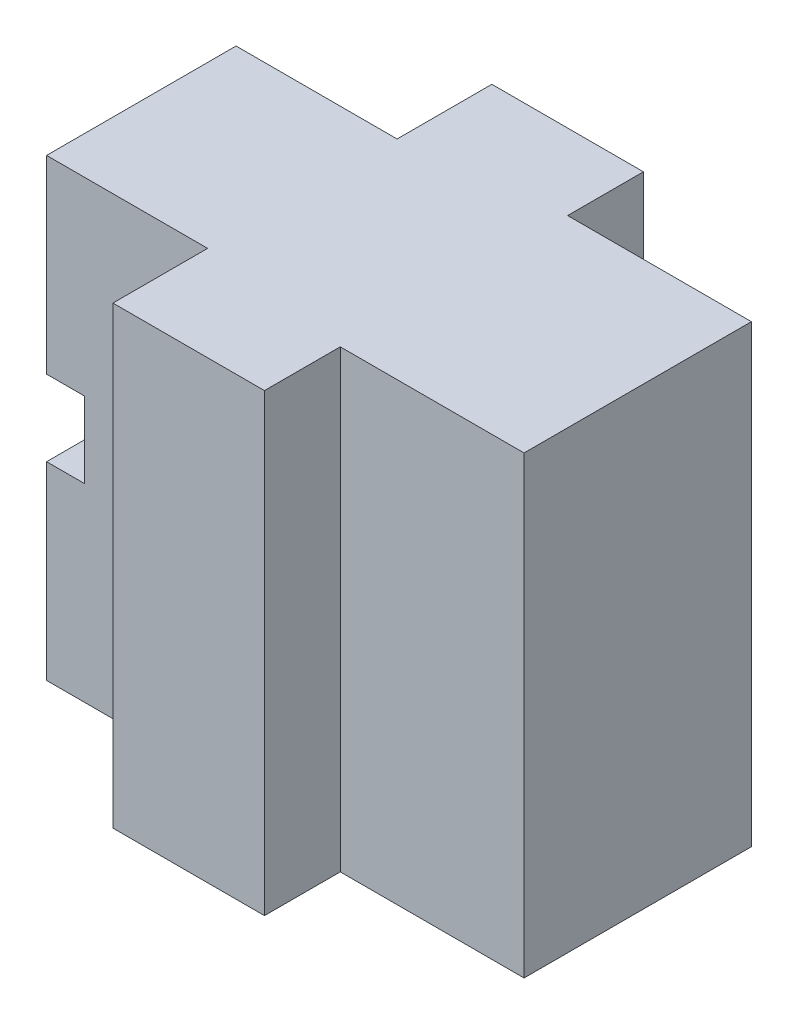
ISO-10303-21;
HEADER;
FILE_DESCRIPTION(('STEP AP214'),'2;1');
FILE_NAME('part.step','',(''),(''),'','','');
FILE_SCHEMA(('AUTOMOTIVE_DESIGN { 1 0 10303 214 1 1 1 1 }'));
ENDSEC;
DATA;
#1=APPLICATION_CONTEXT('core data for automotive mechanical design processes');
#2=APPLICATION_PROTOCOL_DEFINITION('international standard','automotive_design',2000,#1);
#3=PRODUCT_CONTEXT('',#1,'mechanical');
#4=PRODUCT('Part','Part','',(#3));
#5=PRODUCT_RELATED_PRODUCT_CATEGORY('part','',(#4));
#6=PRODUCT_DEFINITION_FORMATION('','',#4);
#7=PRODUCT_DEFINITION_CONTEXT('part definition',#1,'design');
#8=PRODUCT_DEFINITION('design','',#6,#7);
#9=PRODUCT_DEFINITION_SHAPE('','',#8);
#10=(LENGTH_UNIT() NAMED_UNIT(*) SI_UNIT(.MILLI.,.METRE.));
#11=(NAMED_UNIT(*) PLANE_ANGLE_UNIT() SI_UNIT($,.RADIAN.));
#12=(NAMED_UNIT(*) SI_UNIT($,.STERADIAN.) SOLID_ANGLE_UNIT());
#13=UNCERTAINTY_MEASURE_WITH_UNIT(LENGTH_MEASURE(1.E-05),#10,'distance_accuracy_value','');
#14=(GEOMETRIC_REPRESENTATION_CONTEXT(3) GLOBAL_UNCERTAINTY_ASSIGNED_CONTEXT((#13)) GLOBAL_UNIT_ASSIGNED_CONTEXT((#10,
#11,#12)) REPRESENTATION_CONTEXT('',''));
#15=CARTESIAN_POINT('',(0.,0.,0.));
#16=DIRECTION('',(0.,0.,1.));
#17=DIRECTION('',(1.,0.,0.));
#18=AXIS2_PLACEMENT_3D('',#15,#16,#17);
#19=CARTESIAN_POINT('',(0.,12.,5.));
#20=DIRECTION('',(-1.,0.,0.));
#21=DIRECTION('',(0.,-1.,0.));
#22=AXIS2_PLACEMENT_3D('',#19,#20,#21);
#23=PLANE('',#22);
#24=DIRECTION('',(0.,1.,0.));
#25=VECTOR('',#24,1.);
#26=CARTESIAN_POINT('',(0.,-27.4301652615907,-6.));
#27=LINE('',#26,#25);
#28=CARTESIAN_POINT('',(0.,-12.,-6.));
#29=VERTEX_POINT('',#28);
#30=CARTESIAN_POINT('',(0.,12.,-6.));
#31=VERTEX_POINT('',#30);
#32=EDGE_CURVE('E55',#29,#31,#27,.T.);
#33=ORIENTED_EDGE('',*,*,#32,.F.);
#34=DIRECTION('',(0.,0.,-1.));
#35=VECTOR('',#34,1.);
#36=CARTESIAN_POINT('',(0.,-12.,5.));
#37=LINE('',#36,#35);
#38=CARTESIAN_POINT('',(0.,-12.,-10.));
#39=VERTEX_POINT('',#38);
#40=EDGE_CURVE('E271',#29,#39,#37,.T.);
#41=ORIENTED_EDGE('',*,*,#40,.T.);
#42=DIRECTION('',(0.,1.,0.));
#43=VECTOR('',#42,1.);
#44=CARTESIAN_POINT('',(0.,-12.,-10.));
#45=LINE('',#44,#43);
#46=CARTESIAN_POINT('',(0.,12.,-10.));
#47=VERTEX_POINT('',#46);
#48=EDGE_CURVE('E211',#39,#47,#45,.T.);
#49=ORIENTED_EDGE('',*,*,#48,.T.);
#50=DIRECTION('',(0.,0.,-1.));
#51=VECTOR('',#50,1.);
#52=CARTESIAN_POINT('',(0.,12.,5.));
#53=LINE('',#52,#51);
#54=EDGE_CURVE('E269',#31,#47,#53,.T.);
#55=ORIENTED_EDGE('',*,*,#54,.F.);
#56=EDGE_LOOP('',(#33,#41,#49,#55));
#57=FACE_BOUND('',#56,.T.);
#58=ADVANCED_FACE('F32',(#57),#23,.F.);
#59=CARTESIAN_POINT('',(-14.5,-2.,5.));
#60=DIRECTION('',(0.,0.,1.));
#61=DIRECTION('',(1.,0.,0.));
#62=AXIS2_PLACEMENT_3D('',#59,#60,#61);
#63=PLANE('',#62);
#64=DIRECTION('',(1.,0.,0.));
#65=VECTOR('',#64,1.);
#66=CARTESIAN_POINT('',(0.,-12.,5.));
#67=LINE('',#66,#65);
#68=CARTESIAN_POINT('',(-16.5,-12.,5.));
#69=VERTEX_POINT('',#68);
#70=CARTESIAN_POINT('',(-8.,-12.,5.));
#71=VERTEX_POINT('',#70);
#72=EDGE_CURVE('E233',#69,#71,#67,.T.);
#73=ORIENTED_EDGE('',*,*,#72,.T.);
#74=DIRECTION('',(0.,1.,0.));
#75=VECTOR('',#74,1.);
#76=CARTESIAN_POINT('',(-8.,-2.,5.));
#77=LINE('',#76,#75);
#78=CARTESIAN_POINT('',(-8.,12.,5.));
#79=VERTEX_POINT('',#78);
#80=EDGE_CURVE('E223',#71,#79,#77,.T.);
#81=ORIENTED_EDGE('',*,*,#80,.T.);
#82=DIRECTION('',(-1.,0.,0.));
#83=VECTOR('',#82,1.);
#84=CARTESIAN_POINT('',(-16.5,12.,5.));
#85=LINE('',#84,#83);
#86=CARTESIAN_POINT('',(-16.5,12.,5.));
#87=VERTEX_POINT('',#86);
#88=EDGE_CURVE('E235',#79,#87,#85,.T.);
#89=ORIENTED_EDGE('',*,*,#88,.T.);
#90=DIRECTION('',(0.,-1.,0.));
#91=VECTOR('',#90,1.);
#92=CARTESIAN_POINT('',(-16.5,2.,5.));
#93=LINE('',#92,#91);
#94=CARTESIAN_POINT('',(-16.5,2.,5.));
#95=VERTEX_POINT('',#94);
#96=EDGE_CURVE('E237',#87,#95,#93,.T.);
#97=ORIENTED_EDGE('',*,*,#96,.T.);
#98=DIRECTION('',(1.,0.,0.));
#99=VECTOR('',#98,1.);
#100=CARTESIAN_POINT('',(-14.5,2.,5.));
#101=LINE('',#100,#99);
#102=CARTESIAN_POINT('',(-14.5,2.,5.));
#103=VERTEX_POINT('',#102);
#104=EDGE_CURVE('E239',#95,#103,#101,.T.);
#105=ORIENTED_EDGE('',*,*,#104,.T.);
#106=DIRECTION('',(0.,-1.,0.));
#107=VECTOR('',#106,1.);
#108=CARTESIAN_POINT('',(-14.5,-2.,5.));
#109=LINE('',#108,#107);
#110=CARTESIAN_POINT('',(-14.5,-2.,5.));
#111=VERTEX_POINT('',#110);
#112=EDGE_CURVE('E241',#103,#111,#109,.T.);
#113=ORIENTED_EDGE('',*,*,#112,.T.);
#114=DIRECTION('',(-1.,0.,0.));
#115=VECTOR('',#114,1.);
#116=CARTESIAN_POINT('',(-16.5,-2.,5.));
#117=LINE('',#116,#115);
#118=CARTESIAN_POINT('',(-16.5,-2.,5.));
#119=VERTEX_POINT('',#118);
#120=EDGE_CURVE('E227',#111,#119,#117,.T.);
#121=ORIENTED_EDGE('',*,*,#120,.T.);
#122=DIRECTION('',(0.,-1.,0.));
#123=VECTOR('',#122,1.);
#124=CARTESIAN_POINT('',(-16.5,-12.,5.));
#125=LINE('',#124,#123);
#126=EDGE_CURVE('E230',#119,#69,#125,.T.);
#127=ORIENTED_EDGE('',*,*,#126,.T.);
#128=EDGE_LOOP('',(#73,#81,#89,#97,#105,#113,#121,#127));
#129=FACE_BOUND('',#128,.T.);
#130=ADVANCED_FACE('F299',(#129),#63,.T.);
#131=CARTESIAN_POINT('',(-14.5,-2.,-5.));
#132=DIRECTION('',(0.,0.,1.));
#133=DIRECTION('',(1.,0.,0.));
#134=AXIS2_PLACEMENT_3D('',#131,#132,#133);
#135=PLANE('',#134);
#136=DIRECTION('',(0.,1.,0.));
#137=VECTOR('',#136,1.);
#138=CARTESIAN_POINT('',(-8.,-2.,-5.));
#139=LINE('',#138,#137);
#140=CARTESIAN_POINT('',(-8.,-12.,-5.));
#141=VERTEX_POINT('',#140);
#142=CARTESIAN_POINT('',(-8.,12.,-5.));
#143=VERTEX_POINT('',#142);
#144=EDGE_CURVE('E11',#141,#143,#139,.T.);
#145=ORIENTED_EDGE('',*,*,#144,.F.);
#146=DIRECTION('',(1.,0.,0.));
#147=VECTOR('',#146,1.);
#148=CARTESIAN_POINT('',(0.,-12.,-5.));
#149=LINE('',#148,#147);
#150=CARTESIAN_POINT('',(-16.5,-12.,-5.));
#151=VERTEX_POINT('',#150);
#152=EDGE_CURVE('E248',#151,#141,#149,.T.);
#153=ORIENTED_EDGE('',*,*,#152,.F.);
#154=DIRECTION('',(0.,-1.,0.));
#155=VECTOR('',#154,1.);
#156=CARTESIAN_POINT('',(-16.5,-12.,-5.));
#157=LINE('',#156,#155);
#158=CARTESIAN_POINT('',(-16.5,-2.,-5.));
#159=VERTEX_POINT('',#158);
#160=EDGE_CURVE('E246',#159,#151,#157,.T.);
#161=ORIENTED_EDGE('',*,*,#160,.F.);
#162=DIRECTION('',(-1.,0.,0.));
#163=VECTOR('',#162,1.);
#164=CARTESIAN_POINT('',(-16.5,-2.,-5.));
#165=LINE('',#164,#163);
#166=CARTESIAN_POINT('',(-14.5,-2.,-5.));
#167=VERTEX_POINT('',#166);
#168=EDGE_CURVE('E226',#167,#159,#165,.T.);
#169=ORIENTED_EDGE('',*,*,#168,.F.);
#170=DIRECTION('',(0.,-1.,0.));
#171=VECTOR('',#170,1.);
#172=CARTESIAN_POINT('',(-14.5,-2.,-5.));
#173=LINE('',#172,#171);
#174=CARTESIAN_POINT('',(-14.5,2.,-5.));
#175=VERTEX_POINT('',#174);
#176=EDGE_CURVE('E231',#175,#167,#173,.T.);
#177=ORIENTED_EDGE('',*,*,#176,.F.);
#178=DIRECTION('',(1.,0.,0.));
#179=VECTOR('',#178,1.);
#180=CARTESIAN_POINT('',(-14.5,2.,-5.));
#181=LINE('',#180,#179);
#182=CARTESIAN_POINT('',(-16.5,2.,-5.));
#183=VERTEX_POINT('',#182);
#184=EDGE_CURVE('E255',#183,#175,#181,.T.);
#185=ORIENTED_EDGE('',*,*,#184,.F.);
#186=DIRECTION('',(0.,-1.,0.));
#187=VECTOR('',#186,1.);
#188=CARTESIAN_POINT('',(-16.5,2.,-5.));
#189=LINE('',#188,#187);
#190=CARTESIAN_POINT('',(-16.5,12.,-5.));
#191=VERTEX_POINT('',#190);
#192=EDGE_CURVE('E253',#191,#183,#189,.T.);
#193=ORIENTED_EDGE('',*,*,#192,.F.);
#194=DIRECTION('',(-1.,0.,0.));
#195=VECTOR('',#194,1.);
#196=CARTESIAN_POINT('',(-16.5,12.,-5.));
#197=LINE('',#196,#195);
#198=EDGE_CURVE('E251',#143,#191,#197,.T.);
#199=ORIENTED_EDGE('',*,*,#198,.F.);
#200=EDGE_LOOP('',(#145,#153,#161,#169,#177,#185,#193,#199));
#201=FACE_BOUND('',#200,.T.);
#202=ADVANCED_FACE('F288',(#201),#135,.F.);
#203=CARTESIAN_POINT('',(-16.5,-2.,5.));
#204=DIRECTION('',(0.,-1.,0.));
#205=DIRECTION('',(0.,0.,-1.));
#206=AXIS2_PLACEMENT_3D('',#203,#204,#205);
#207=PLANE('',#206);
#208=ORIENTED_EDGE('',*,*,#168,.T.);
#209=DIRECTION('',(0.,0.,-1.));
#210=VECTOR('',#209,1.);
#211=CARTESIAN_POINT('',(-16.5,-2.,5.));
#212=LINE('',#211,#210);
#213=EDGE_CURVE('E40',#119,#159,#212,.T.);
#214=ORIENTED_EDGE('',*,*,#213,.F.);
#215=ORIENTED_EDGE('',*,*,#120,.F.);
#216=DIRECTION('',(0.,0.,-1.));
#217=VECTOR('',#216,1.);
#218=CARTESIAN_POINT('',(-14.5,-2.,5.));
#219=LINE('',#218,#217);
#220=EDGE_CURVE('E243',#111,#167,#219,.T.);
#221=ORIENTED_EDGE('',*,*,#220,.T.);
#222=EDGE_LOOP('',(#208,#214,#215,#221));
#223=FACE_BOUND('',#222,.T.);
#224=ADVANCED_FACE('F34',(#223),#207,.F.);
#225=CARTESIAN_POINT('',(-16.5,-12.,5.));
#226=DIRECTION('',(1.,0.,0.));
#227=DIRECTION('',(0.,0.,-1.));
#228=AXIS2_PLACEMENT_3D('',#225,#226,#227);
#229=PLANE('',#228);
#230=CARTESIAN_POINT('',(-16.5,-7.,0.));
#231=DIRECTION('',(-1.,0.,0.));
#232=DIRECTION('',(0.,0.,1.));
#233=AXIS2_PLACEMENT_3D('',#230,#231,#232);
#234=CIRCLE('',#233,2.5);
#235=CARTESIAN_POINT('',(-16.5,-7.,2.5));
#236=VERTEX_POINT('',#235);
#237=EDGE_CURVE('E180',#236,#236,#234,.T.);
#238=ORIENTED_EDGE('',*,*,#237,.F.);
#239=EDGE_LOOP('',(#238));
#240=FACE_BOUND('',#239,.T.);
#241=ORIENTED_EDGE('',*,*,#160,.T.);
#242=DIRECTION('',(0.,0.,-1.));
#243=VECTOR('',#242,1.);
#244=CARTESIAN_POINT('',(-16.5,-12.,5.));
#245=LINE('',#244,#243);
#246=EDGE_CURVE('E274',#69,#151,#245,.T.);
#247=ORIENTED_EDGE('',*,*,#246,.F.);
#248=ORIENTED_EDGE('',*,*,#126,.F.);
#249=ORIENTED_EDGE('',*,*,#213,.T.);
#250=EDGE_LOOP('',(#241,#247,#248,#249));
#251=FACE_BOUND('',#250,.T.);
#252=ADVANCED_FACE('F279',(#240,#251),#229,.F.);
#253=CARTESIAN_POINT('',(0.,-12.,5.));
#254=DIRECTION('',(0.,1.,0.));
#255=DIRECTION('',(-1.,0.,0.));
#256=AXIS2_PLACEMENT_3D('',#253,#254,#255);
#257=PLANE('',#256);
#258=CARTESIAN_POINT('',(0.,-12.,10.));
#259=VERTEX_POINT('',#258);
#260=CARTESIAN_POINT('',(0.,-12.,6.));
#261=VERTEX_POINT('',#260);
#262=EDGE_CURVE('E272',#259,#261,#37,.T.);
#263=ORIENTED_EDGE('',*,*,#262,.F.);
#264=DIRECTION('',(1.,0.,0.));
#265=VECTOR('',#264,1.);
#266=CARTESIAN_POINT('',(-8.,-12.,10.));
#267=LINE('',#266,#265);
#268=CARTESIAN_POINT('',(-8.,-12.,10.));
#269=VERTEX_POINT('',#268);
#270=EDGE_CURVE('E196',#269,#259,#267,.T.);
#271=ORIENTED_EDGE('',*,*,#270,.F.);
#272=DIRECTION('',(0.,0.,-1.));
#273=VECTOR('',#272,1.);
#274=CARTESIAN_POINT('',(-8.,-12.,10.));
#275=LINE('',#274,#273);
#276=EDGE_CURVE('E220',#269,#71,#275,.T.);
#277=ORIENTED_EDGE('',*,*,#276,.T.);
#278=ORIENTED_EDGE('',*,*,#72,.F.);
#279=ORIENTED_EDGE('',*,*,#246,.T.);
#280=ORIENTED_EDGE('',*,*,#152,.T.);
#281=CARTESIAN_POINT('',(-8.,-12.,-10.));
#282=VERTEX_POINT('',#281);
#283=EDGE_CURVE('E219',#141,#282,#275,.T.);
#284=ORIENTED_EDGE('',*,*,#283,.T.);
#285=DIRECTION('',(1.,0.,0.));
#286=VECTOR('',#285,1.);
#287=CARTESIAN_POINT('',(-8.,-12.,-10.));
#288=LINE('',#287,#286);
#289=EDGE_CURVE('E208',#282,#39,#288,.T.);
#290=ORIENTED_EDGE('',*,*,#289,.T.);
#291=ORIENTED_EDGE('',*,*,#40,.F.);
#292=DIRECTION('',(1.,0.,0.));
#293=VECTOR('',#292,1.);
#294=CARTESIAN_POINT('',(0.,-12.,-6.));
#295=LINE('',#294,#293);
#296=CARTESIAN_POINT('',(9.7,-12.,-6.));
#297=VERTEX_POINT('',#296);
#298=EDGE_CURVE('E171',#29,#297,#295,.T.);
#299=ORIENTED_EDGE('',*,*,#298,.T.);
#300=DIRECTION('',(0.,0.,1.));
#301=VECTOR('',#300,1.);
#302=CARTESIAN_POINT('',(9.7,-12.,6.));
#303=LINE('',#302,#301);
#304=CARTESIAN_POINT('',(9.7,-12.,6.));
#305=VERTEX_POINT('',#304);
#306=EDGE_CURVE('E176',#297,#305,#303,.T.);
#307=ORIENTED_EDGE('',*,*,#306,.T.);
#308=DIRECTION('',(-1.,0.,0.));
#309=VECTOR('',#308,1.);
#310=CARTESIAN_POINT('',(0.,-12.,6.));
#311=LINE('',#310,#309);
#312=EDGE_CURVE('E152',#305,#261,#311,.T.);
#313=ORIENTED_EDGE('',*,*,#312,.T.);
#314=EDGE_LOOP('',(#263,#271,#277,#278,#279,#280,#284,#290,#291,#299,#307,#313));
#315=FACE_BOUND('',#314,.T.);
#316=ADVANCED_FACE('F293',(#315),#257,.F.);
#317=ORIENTED_EDGE('',*,*,#262,.T.);
#318=DIRECTION('',(0.,1.,0.));
#319=VECTOR('',#318,1.);
#320=CARTESIAN_POINT('',(0.,-27.4301652615907,6.));
#321=LINE('',#320,#319);
#322=CARTESIAN_POINT('',(0.,12.,6.));
#323=VERTEX_POINT('',#322);
#324=EDGE_CURVE('E47',#261,#323,#321,.T.);
#325=ORIENTED_EDGE('',*,*,#324,.T.);
#326=CARTESIAN_POINT('',(0.,12.,10.));
#327=VERTEX_POINT('',#326);
#328=EDGE_CURVE('E168',#327,#323,#53,.T.);
#329=ORIENTED_EDGE('',*,*,#328,.F.);
#330=DIRECTION('',(0.,1.,0.));
#331=VECTOR('',#330,1.);
#332=CARTESIAN_POINT('',(0.,-12.,10.));
#333=LINE('',#332,#331);
#334=EDGE_CURVE('E200',#259,#327,#333,.T.);
#335=ORIENTED_EDGE('',*,*,#334,.F.);
#336=EDGE_LOOP('',(#317,#325,#329,#335));
#337=FACE_BOUND('',#336,.T.);
#338=ADVANCED_FACE('F331',(#337),#23,.F.);
#339=CARTESIAN_POINT('',(-16.5,12.,5.));
#340=DIRECTION('',(0.,-1.,0.));
#341=DIRECTION('',(1.,0.,0.));
#342=AXIS2_PLACEMENT_3D('',#339,#340,#341);
#343=PLANE('',#342);
#344=ORIENTED_EDGE('',*,*,#328,.T.);
#345=DIRECTION('',(1.,0.,0.));
#346=VECTOR('',#345,1.);
#347=CARTESIAN_POINT('',(0.,12.,6.));
#348=LINE('',#347,#346);
#349=CARTESIAN_POINT('',(9.7,12.,6.));
#350=VERTEX_POINT('',#349);
#351=EDGE_CURVE('E150',#323,#350,#348,.T.);
#352=ORIENTED_EDGE('',*,*,#351,.T.);
#353=DIRECTION('',(0.,0.,-1.));
#354=VECTOR('',#353,1.);
#355=CARTESIAN_POINT('',(9.7,12.,6.));
#356=LINE('',#355,#354);
#357=CARTESIAN_POINT('',(9.7,12.,-6.));
#358=VERTEX_POINT('',#357);
#359=EDGE_CURVE('E158',#350,#358,#356,.T.);
#360=ORIENTED_EDGE('',*,*,#359,.T.);
#361=DIRECTION('',(-1.,0.,0.));
#362=VECTOR('',#361,1.);
#363=CARTESIAN_POINT('',(0.,12.,-6.));
#364=LINE('',#363,#362);
#365=EDGE_CURVE('E164',#358,#31,#364,.T.);
#366=ORIENTED_EDGE('',*,*,#365,.T.);
#367=ORIENTED_EDGE('',*,*,#54,.T.);
#368=DIRECTION('',(-1.,0.,0.));
#369=VECTOR('',#368,1.);
#370=CARTESIAN_POINT('',(0.,12.,-10.));
#371=LINE('',#370,#369);
#372=CARTESIAN_POINT('',(-8.,12.,-10.));
#373=VERTEX_POINT('',#372);
#374=EDGE_CURVE('E197',#47,#373,#371,.T.);
#375=ORIENTED_EDGE('',*,*,#374,.T.);
#376=DIRECTION('',(0.,0.,-1.));
#377=VECTOR('',#376,1.);
#378=CARTESIAN_POINT('',(-8.,12.,10.));
#379=LINE('',#378,#377);
#380=EDGE_CURVE('E205',#143,#373,#379,.T.);
#381=ORIENTED_EDGE('',*,*,#380,.F.);
#382=ORIENTED_EDGE('',*,*,#198,.T.);
#383=DIRECTION('',(0.,0.,-1.));
#384=VECTOR('',#383,1.);
#385=CARTESIAN_POINT('',(-16.5,12.,5.));
#386=LINE('',#385,#384);
#387=EDGE_CURVE('E266',#87,#191,#386,.T.);
#388=ORIENTED_EDGE('',*,*,#387,.F.);
#389=ORIENTED_EDGE('',*,*,#88,.F.);
#390=CARTESIAN_POINT('',(-8.,12.,10.));
#391=VERTEX_POINT('',#390);
#392=EDGE_CURVE('E216',#391,#79,#379,.T.);
#393=ORIENTED_EDGE('',*,*,#392,.F.);
#394=DIRECTION('',(-1.,0.,0.));
#395=VECTOR('',#394,1.);
#396=CARTESIAN_POINT('',(0.,12.,10.));
#397=LINE('',#396,#395);
#398=EDGE_CURVE('E203',#327,#391,#397,.T.);
#399=ORIENTED_EDGE('',*,*,#398,.F.);
#400=EDGE_LOOP('',(#344,#352,#360,#366,#367,#375,#381,#382,#388,#389,#393,#399));
#401=FACE_BOUND('',#400,.T.);
#402=ADVANCED_FACE('F166',(#401),#343,.F.);
#403=CARTESIAN_POINT('',(-16.5,2.,5.));
#404=DIRECTION('',(1.,0.,0.));
#405=DIRECTION('',(0.,1.,0.));
#406=AXIS2_PLACEMENT_3D('',#403,#404,#405);
#407=PLANE('',#406);
#408=CARTESIAN_POINT('',(-16.5,7.,0.));
#409=DIRECTION('',(-1.,0.,0.));
#410=DIRECTION('',(0.,0.,1.));
#411=AXIS2_PLACEMENT_3D('',#408,#409,#410);
#412=CIRCLE('',#411,2.5);
#413=CARTESIAN_POINT('',(-16.5,7.,2.5));
#414=VERTEX_POINT('',#413);
#415=EDGE_CURVE('E184',#414,#414,#412,.T.);
#416=ORIENTED_EDGE('',*,*,#415,.F.);
#417=EDGE_LOOP('',(#416));
#418=FACE_BOUND('',#417,.T.);
#419=ORIENTED_EDGE('',*,*,#192,.T.);
#420=DIRECTION('',(0.,0.,-1.));
#421=VECTOR('',#420,1.);
#422=CARTESIAN_POINT('',(-16.5,2.,5.));
#423=LINE('',#422,#421);
#424=EDGE_CURVE('E263',#95,#183,#423,.T.);
#425=ORIENTED_EDGE('',*,*,#424,.F.);
#426=ORIENTED_EDGE('',*,*,#96,.F.);
#427=ORIENTED_EDGE('',*,*,#387,.T.);
#428=EDGE_LOOP('',(#419,#425,#426,#427));
#429=FACE_BOUND('',#428,.T.);
#430=ADVANCED_FACE('F310',(#418,#429),#407,.F.);
#431=CARTESIAN_POINT('',(-14.5,2.,5.));
#432=DIRECTION('',(0.,1.,0.));
#433=DIRECTION('',(0.,0.,1.));
#434=AXIS2_PLACEMENT_3D('',#431,#432,#433);
#435=PLANE('',#434);
#436=ORIENTED_EDGE('',*,*,#184,.T.);
#437=DIRECTION('',(0.,0.,-1.));
#438=VECTOR('',#437,1.);
#439=CARTESIAN_POINT('',(-14.5,2.,5.));
#440=LINE('',#439,#438);
#441=EDGE_CURVE('E260',#103,#175,#440,.T.);
#442=ORIENTED_EDGE('',*,*,#441,.F.);
#443=ORIENTED_EDGE('',*,*,#104,.F.);
#444=ORIENTED_EDGE('',*,*,#424,.T.);
#445=EDGE_LOOP('',(#436,#442,#443,#444));
#446=FACE_BOUND('',#445,.T.);
#447=ADVANCED_FACE('F313',(#446),#435,.F.);
#448=CARTESIAN_POINT('',(-14.5,-2.,5.));
#449=DIRECTION('',(1.,0.,0.));
#450=DIRECTION('',(0.,0.,-1.));
#451=AXIS2_PLACEMENT_3D('',#448,#449,#450);
#452=PLANE('',#451);
#453=ORIENTED_EDGE('',*,*,#176,.T.);
#454=ORIENTED_EDGE('',*,*,#220,.F.);
#455=ORIENTED_EDGE('',*,*,#112,.F.);
#456=ORIENTED_EDGE('',*,*,#441,.T.);
#457=EDGE_LOOP('',(#453,#454,#455,#456));
#458=FACE_BOUND('',#457,.T.);
#459=ADVANCED_FACE('F316',(#458),#452,.F.);
#460=CARTESIAN_POINT('',(-8.,-12.,-10.));
#461=DIRECTION('',(0.,0.,1.));
#462=DIRECTION('',(1.,0.,0.));
#463=AXIS2_PLACEMENT_3D('',#460,#461,#462);
#464=PLANE('',#463);
#465=DIRECTION('',(0.,-1.,0.));
#466=VECTOR('',#465,1.);
#467=CARTESIAN_POINT('',(-8.,12.,-10.));
#468=LINE('',#467,#466);
#469=EDGE_CURVE('E190',#373,#282,#468,.T.);
#470=ORIENTED_EDGE('',*,*,#469,.F.);
#471=ORIENTED_EDGE('',*,*,#374,.F.);
#472=ORIENTED_EDGE('',*,*,#48,.F.);
#473=ORIENTED_EDGE('',*,*,#289,.F.);
#474=EDGE_LOOP('',(#470,#471,#472,#473));
#475=FACE_BOUND('',#474,.T.);
#476=ADVANCED_FACE('F318',(#475),#464,.F.);
#477=CARTESIAN_POINT('',(-8.,12.,10.));
#478=DIRECTION('',(1.,0.,0.));
#479=DIRECTION('',(0.,1.,0.));
#480=AXIS2_PLACEMENT_3D('',#477,#478,#479);
#481=PLANE('',#480);
#482=ORIENTED_EDGE('',*,*,#283,.F.);
#483=ORIENTED_EDGE('',*,*,#144,.T.);
#484=ORIENTED_EDGE('',*,*,#380,.T.);
#485=ORIENTED_EDGE('',*,*,#469,.T.);
#486=EDGE_LOOP('',(#482,#483,#484,#485));
#487=FACE_BOUND('',#486,.T.);
#488=ADVANCED_FACE('F324',(#487),#481,.F.);
#489=ORIENTED_EDGE('',*,*,#80,.F.);
#490=ORIENTED_EDGE('',*,*,#276,.F.);
#491=DIRECTION('',(0.,-1.,0.));
#492=VECTOR('',#491,1.);
#493=CARTESIAN_POINT('',(-8.,12.,10.));
#494=LINE('',#493,#492);
#495=EDGE_CURVE('E193',#391,#269,#494,.T.);
#496=ORIENTED_EDGE('',*,*,#495,.F.);
#497=ORIENTED_EDGE('',*,*,#392,.T.);
#498=EDGE_LOOP('',(#489,#490,#496,#497));
#499=FACE_BOUND('',#498,.T.);
#500=ADVANCED_FACE('F301',(#499),#481,.F.);
#501=CARTESIAN_POINT('',(-8.,-12.,10.));
#502=DIRECTION('',(0.,0.,1.));
#503=DIRECTION('',(1.,0.,0.));
#504=AXIS2_PLACEMENT_3D('',#501,#502,#503);
#505=PLANE('',#504);
#506=ORIENTED_EDGE('',*,*,#495,.T.);
#507=ORIENTED_EDGE('',*,*,#270,.T.);
#508=ORIENTED_EDGE('',*,*,#334,.T.);
#509=ORIENTED_EDGE('',*,*,#398,.T.);
#510=EDGE_LOOP('',(#506,#507,#508,#509));
#511=FACE_BOUND('',#510,.T.);
#512=ADVANCED_FACE('F356',(#511),#505,.T.);
#513=CARTESIAN_POINT('',(-6.5,7.,0.));
#514=DIRECTION('',(-1.,0.,0.));
#515=DIRECTION('',(0.,0.,1.));
#516=AXIS2_PLACEMENT_3D('',#513,#514,#515);
#517=CYLINDRICAL_SURFACE('',#516,2.5);
#518=CARTESIAN_POINT('',(-6.5,7.,0.));
#519=DIRECTION('',(-1.,0.,0.));
#520=DIRECTION('',(0.,0.,1.));
#521=AXIS2_PLACEMENT_3D('',#518,#519,#520);
#522=CIRCLE('',#521,2.5);
#523=CARTESIAN_POINT('',(-6.5,7.,2.5));
#524=VERTEX_POINT('',#523);
#525=EDGE_CURVE('E187',#524,#524,#522,.T.);
#526=ORIENTED_EDGE('',*,*,#525,.F.);
#527=EDGE_LOOP('',(#526));
#528=FACE_BOUND('',#527,.T.);
#529=ORIENTED_EDGE('',*,*,#415,.T.);
#530=EDGE_LOOP('',(#529));
#531=FACE_BOUND('',#530,.T.);
#532=ADVANCED_FACE('F382',(#528,#531),#517,.F.);
#533=CARTESIAN_POINT('',(-6.5,7.,0.));
#534=DIRECTION('',(-1.,0.,0.));
#535=DIRECTION('',(0.,0.,1.));
#536=AXIS2_PLACEMENT_3D('',#533,#534,#535);
#537=PLANE('',#536);
#538=ORIENTED_EDGE('',*,*,#525,.T.);
#539=EDGE_LOOP('',(#538));
#540=FACE_BOUND('',#539,.T.);
#541=ADVANCED_FACE('F373',(#540),#537,.T.);
#542=CARTESIAN_POINT('',(-6.5,-7.,0.));
#543=DIRECTION('',(-1.,0.,0.));
#544=DIRECTION('',(0.,0.,1.));
#545=AXIS2_PLACEMENT_3D('',#542,#543,#544);
#546=CYLINDRICAL_SURFACE('',#545,2.5);
#547=CARTESIAN_POINT('',(-6.5,-7.,0.));
#548=DIRECTION('',(-1.,0.,0.));
#549=DIRECTION('',(0.,0.,1.));
#550=AXIS2_PLACEMENT_3D('',#547,#548,#549);
#551=CIRCLE('',#550,2.5);
#552=CARTESIAN_POINT('',(-6.5,-7.,2.5));
#553=VERTEX_POINT('',#552);
#554=EDGE_CURVE('E181',#553,#553,#551,.T.);
#555=ORIENTED_EDGE('',*,*,#554,.F.);
#556=EDGE_LOOP('',(#555));
#557=FACE_BOUND('',#556,.T.);
#558=ORIENTED_EDGE('',*,*,#237,.T.);
#559=EDGE_LOOP('',(#558));
#560=FACE_BOUND('',#559,.T.);
#561=ADVANCED_FACE('F370',(#557,#560),#546,.F.);
#562=CARTESIAN_POINT('',(-6.5,-7.,0.));
#563=DIRECTION('',(-1.,0.,0.));
#564=DIRECTION('',(0.,0.,1.));
#565=AXIS2_PLACEMENT_3D('',#562,#563,#564);
#566=PLANE('',#565);
#567=ORIENTED_EDGE('',*,*,#554,.T.);
#568=EDGE_LOOP('',(#567));
#569=FACE_BOUND('',#568,.T.);
#570=ADVANCED_FACE('F372',(#569),#566,.T.);
#571=CARTESIAN_POINT('',(0.,-27.4301652615907,-6.));
#572=DIRECTION('',(0.,0.,-1.));
#573=DIRECTION('',(-1.,0.,0.));
#574=AXIS2_PLACEMENT_3D('',#571,#572,#573);
#575=PLANE('',#574);
#576=ORIENTED_EDGE('',*,*,#298,.F.);
#577=ORIENTED_EDGE('',*,*,#32,.T.);
#578=ORIENTED_EDGE('',*,*,#365,.F.);
#579=DIRECTION('',(0.,1.,0.));
#580=VECTOR('',#579,1.);
#581=CARTESIAN_POINT('',(9.7,-27.4301652615907,-6.));
#582=LINE('',#581,#580);
#583=EDGE_CURVE('E155',#297,#358,#582,.T.);
#584=ORIENTED_EDGE('',*,*,#583,.F.);
#585=EDGE_LOOP('',(#576,#577,#578,#584));
#586=FACE_BOUND('',#585,.T.);
#587=ADVANCED_FACE('F346',(#586),#575,.T.);
#588=CARTESIAN_POINT('',(9.7,-27.4301652615907,6.));
#589=DIRECTION('',(1.,0.,0.));
#590=DIRECTION('',(0.,0.,-1.));
#591=AXIS2_PLACEMENT_3D('',#588,#589,#590);
#592=PLANE('',#591);
#593=ORIENTED_EDGE('',*,*,#306,.F.);
#594=ORIENTED_EDGE('',*,*,#583,.T.);
#595=ORIENTED_EDGE('',*,*,#359,.F.);
#596=DIRECTION('',(0.,1.,0.));
#597=VECTOR('',#596,1.);
#598=CARTESIAN_POINT('',(9.7,-27.4301652615907,6.));
#599=LINE('',#598,#597);
#600=EDGE_CURVE('E146',#305,#350,#599,.T.);
#601=ORIENTED_EDGE('',*,*,#600,.F.);
#602=EDGE_LOOP('',(#593,#594,#595,#601));
#603=FACE_BOUND('',#602,.T.);
#604=ADVANCED_FACE('F159',(#603),#592,.T.);
#605=CARTESIAN_POINT('',(0.,-27.4301652615907,6.));
#606=DIRECTION('',(0.,0.,1.));
#607=DIRECTION('',(1.,0.,0.));
#608=AXIS2_PLACEMENT_3D('',#605,#606,#607);
#609=PLANE('',#608);
#610=ORIENTED_EDGE('',*,*,#312,.F.);
#611=ORIENTED_EDGE('',*,*,#600,.T.);
#612=ORIENTED_EDGE('',*,*,#351,.F.);
#613=ORIENTED_EDGE('',*,*,#324,.F.);
#614=EDGE_LOOP('',(#610,#611,#612,#613));
#615=FACE_BOUND('',#614,.T.);
#616=ADVANCED_FACE('F148',(#615),#609,.T.);
#617=CLOSED_SHELL('',(#58,#130,#202,#224,#252,#316,#338,#402,#430,#447,#459,#476,#488,#500,#512,
#532,#541,#561,#570,#587,#604,#616));
#618=MANIFOLD_SOLID_BREP('B2',#617);
#619=ADVANCED_BREP_SHAPE_REPRESENTATION('',(#18,#618),#14);
#620=SHAPE_DEFINITION_REPRESENTATION(#9,#619);
ENDSEC;
END-ISO-10303-21;
